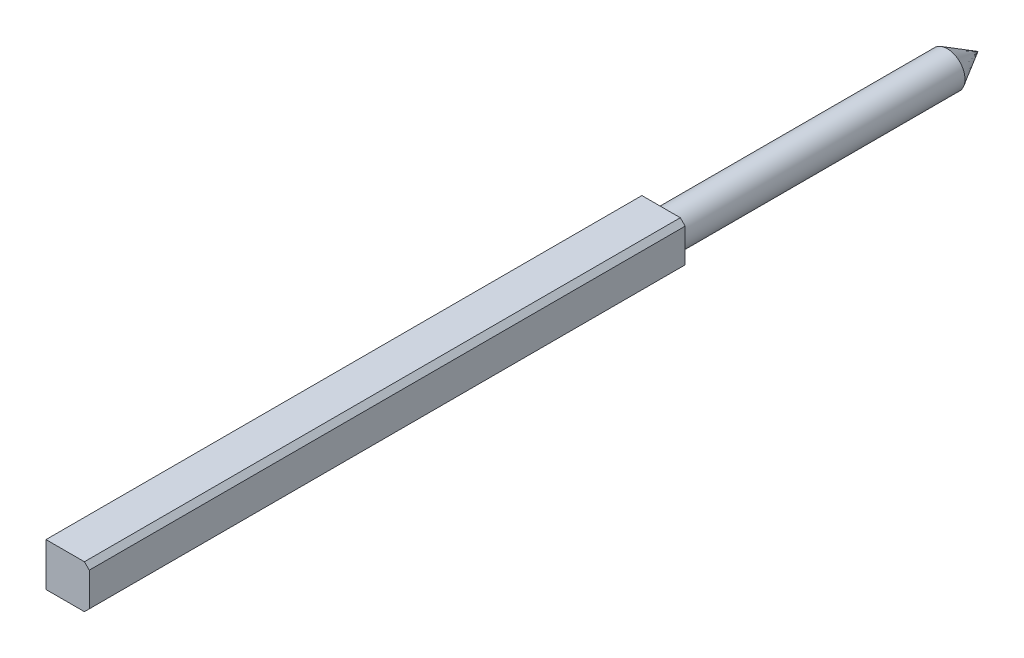
ISO-10303-21;
HEADER;
FILE_DESCRIPTION(('STEP AP214'),'2;1');
FILE_NAME('part.step','',(''),(''),'','','');
FILE_SCHEMA(('AUTOMOTIVE_DESIGN { 1 0 10303 214 1 1 1 1 }'));
ENDSEC;
DATA;
#1=APPLICATION_CONTEXT('core data for automotive mechanical design processes');
#2=APPLICATION_PROTOCOL_DEFINITION('international standard','automotive_design',2000,#1);
#3=PRODUCT_CONTEXT('',#1,'mechanical');
#4=PRODUCT('Part','Part','',(#3));
#5=PRODUCT_RELATED_PRODUCT_CATEGORY('part','',(#4));
#6=PRODUCT_DEFINITION_FORMATION('','',#4);
#7=PRODUCT_DEFINITION_CONTEXT('part definition',#1,'design');
#8=PRODUCT_DEFINITION('design','',#6,#7);
#9=PRODUCT_DEFINITION_SHAPE('','',#8);
#10=(LENGTH_UNIT() NAMED_UNIT(*) SI_UNIT(.MILLI.,.METRE.));
#11=(NAMED_UNIT(*) PLANE_ANGLE_UNIT() SI_UNIT($,.RADIAN.));
#12=(NAMED_UNIT(*) SI_UNIT($,.STERADIAN.) SOLID_ANGLE_UNIT());
#13=UNCERTAINTY_MEASURE_WITH_UNIT(LENGTH_MEASURE(1.E-05),#10,'distance_accuracy_value','');
#14=(GEOMETRIC_REPRESENTATION_CONTEXT(3) GLOBAL_UNCERTAINTY_ASSIGNED_CONTEXT((#13)) GLOBAL_UNIT_ASSIGNED_CONTEXT((#10,
#11,#12)) REPRESENTATION_CONTEXT('',''));
#15=CARTESIAN_POINT('',(0.,0.,0.));
#16=DIRECTION('',(0.,0.,1.));
#17=DIRECTION('',(1.,0.,0.));
#18=AXIS2_PLACEMENT_3D('',#15,#16,#17);
#19=CARTESIAN_POINT('',(-3.05,-3.05,84.));
#20=DIRECTION('',(0.,1.,0.));
#21=DIRECTION('',(0.,0.,1.));
#22=AXIS2_PLACEMENT_3D('',#19,#20,#21);
#23=PLANE('',#22);
#24=DIRECTION('',(1.,0.,0.));
#25=VECTOR('',#24,1.);
#26=CARTESIAN_POINT('',(-3.05,-3.05,0.));
#27=LINE('',#26,#25);
#28=CARTESIAN_POINT('',(-3.05,-3.05,0.));
#29=VERTEX_POINT('',#28);
#30=CARTESIAN_POINT('',(2.36400000000001,-3.05,0.));
#31=VERTEX_POINT('',#30);
#32=EDGE_CURVE('E119',#29,#31,#27,.T.);
#33=ORIENTED_EDGE('',*,*,#32,.T.);
#34=DIRECTION('',(0.,0.,1.));
#35=VECTOR('',#34,1.);
#36=CARTESIAN_POINT('',(2.36400000000001,-3.05,84.));
#37=LINE('',#36,#35);
#38=CARTESIAN_POINT('',(2.36400000000001,-3.05,84.));
#39=VERTEX_POINT('',#38);
#40=EDGE_CURVE('E71',#31,#39,#37,.T.);
#41=ORIENTED_EDGE('',*,*,#40,.T.);
#42=DIRECTION('',(1.,0.,0.));
#43=VECTOR('',#42,1.);
#44=CARTESIAN_POINT('',(-3.05,-3.05,84.));
#45=LINE('',#44,#43);
#46=CARTESIAN_POINT('',(-3.05,-3.05,84.));
#47=VERTEX_POINT('',#46);
#48=EDGE_CURVE('E122',#47,#39,#45,.T.);
#49=ORIENTED_EDGE('',*,*,#48,.F.);
#50=DIRECTION('',(0.,0.,-1.));
#51=VECTOR('',#50,1.);
#52=CARTESIAN_POINT('',(-3.05,-3.05,84.));
#53=LINE('',#52,#51);
#54=EDGE_CURVE('E132',#47,#29,#53,.T.);
#55=ORIENTED_EDGE('',*,*,#54,.T.);
#56=EDGE_LOOP('',(#33,#41,#49,#55));
#57=FACE_BOUND('',#56,.T.);
#58=ADVANCED_FACE('F47',(#57),#23,.F.);
#59=CARTESIAN_POINT('',(3.05,-3.05,84.));
#60=DIRECTION('',(-1.,0.,0.));
#61=DIRECTION('',(0.,0.,1.));
#62=AXIS2_PLACEMENT_3D('',#59,#60,#61);
#63=PLANE('',#62);
#64=DIRECTION('',(0.,1.,0.));
#65=VECTOR('',#64,1.);
#66=CARTESIAN_POINT('',(3.05,-3.05,84.));
#67=LINE('',#66,#65);
#68=CARTESIAN_POINT('',(3.05,-2.36400000000001,84.));
#69=VERTEX_POINT('',#68);
#70=CARTESIAN_POINT('',(3.05,2.36400000000001,84.));
#71=VERTEX_POINT('',#70);
#72=EDGE_CURVE('E124',#69,#71,#67,.T.);
#73=ORIENTED_EDGE('',*,*,#72,.F.);
#74=DIRECTION('',(0.,0.,-1.));
#75=VECTOR('',#74,1.);
#76=CARTESIAN_POINT('',(3.05,-2.36400000000001,84.));
#77=LINE('',#76,#75);
#78=CARTESIAN_POINT('',(3.05,-2.36400000000001,0.));
#79=VERTEX_POINT('',#78);
#80=EDGE_CURVE('E147',#69,#79,#77,.T.);
#81=ORIENTED_EDGE('',*,*,#80,.T.);
#82=DIRECTION('',(0.,1.,0.));
#83=VECTOR('',#82,1.);
#84=CARTESIAN_POINT('',(3.05,-3.05,0.));
#85=LINE('',#84,#83);
#86=CARTESIAN_POINT('',(3.05,2.36400000000001,0.));
#87=VERTEX_POINT('',#86);
#88=EDGE_CURVE('E134',#79,#87,#85,.T.);
#89=ORIENTED_EDGE('',*,*,#88,.T.);
#90=DIRECTION('',(0.,0.,1.));
#91=VECTOR('',#90,1.);
#92=CARTESIAN_POINT('',(3.05,2.36400000000001,84.));
#93=LINE('',#92,#91);
#94=EDGE_CURVE('E145',#87,#71,#93,.T.);
#95=ORIENTED_EDGE('',*,*,#94,.T.);
#96=EDGE_LOOP('',(#73,#81,#89,#95));
#97=FACE_BOUND('',#96,.T.);
#98=ADVANCED_FACE('F162',(#97),#63,.F.);
#99=CARTESIAN_POINT('',(-3.05,3.05,84.));
#100=DIRECTION('',(0.,1.,0.));
#101=DIRECTION('',(0.,0.,1.));
#102=AXIS2_PLACEMENT_3D('',#99,#100,#101);
#103=PLANE('',#102);
#104=DIRECTION('',(1.,0.,0.));
#105=VECTOR('',#104,1.);
#106=CARTESIAN_POINT('',(-3.05,3.05,84.));
#107=LINE('',#106,#105);
#108=CARTESIAN_POINT('',(-3.05,3.05,84.));
#109=VERTEX_POINT('',#108);
#110=CARTESIAN_POINT('',(2.36400000000001,3.05,84.));
#111=VERTEX_POINT('',#110);
#112=EDGE_CURVE('E127',#109,#111,#107,.T.);
#113=ORIENTED_EDGE('',*,*,#112,.T.);
#114=DIRECTION('',(0.,0.,-1.));
#115=VECTOR('',#114,1.);
#116=CARTESIAN_POINT('',(2.36400000000001,3.05,0.));
#117=LINE('',#116,#115);
#118=CARTESIAN_POINT('',(2.36400000000001,3.05,0.));
#119=VERTEX_POINT('',#118);
#120=EDGE_CURVE('E12',#111,#119,#117,.T.);
#121=ORIENTED_EDGE('',*,*,#120,.T.);
#122=DIRECTION('',(1.,0.,0.));
#123=VECTOR('',#122,1.);
#124=CARTESIAN_POINT('',(-3.05,3.05,0.));
#125=LINE('',#124,#123);
#126=CARTESIAN_POINT('',(-3.05,3.05,0.));
#127=VERTEX_POINT('',#126);
#128=EDGE_CURVE('E137',#127,#119,#125,.T.);
#129=ORIENTED_EDGE('',*,*,#128,.F.);
#130=DIRECTION('',(0.,0.,-1.));
#131=VECTOR('',#130,1.);
#132=CARTESIAN_POINT('',(-3.05,3.05,84.));
#133=LINE('',#132,#131);
#134=EDGE_CURVE('E143',#109,#127,#133,.T.);
#135=ORIENTED_EDGE('',*,*,#134,.F.);
#136=EDGE_LOOP('',(#113,#121,#129,#135));
#137=FACE_BOUND('',#136,.T.);
#138=ADVANCED_FACE('F173',(#137),#103,.T.);
#139=CARTESIAN_POINT('',(-3.05,-3.05,84.));
#140=DIRECTION('',(-1.,0.,0.));
#141=DIRECTION('',(0.,0.,1.));
#142=AXIS2_PLACEMENT_3D('',#139,#140,#141);
#143=PLANE('',#142);
#144=DIRECTION('',(0.,1.,0.));
#145=VECTOR('',#144,1.);
#146=CARTESIAN_POINT('',(-3.05,-3.05,0.));
#147=LINE('',#146,#145);
#148=EDGE_CURVE('E125',#29,#127,#147,.T.);
#149=ORIENTED_EDGE('',*,*,#148,.F.);
#150=ORIENTED_EDGE('',*,*,#54,.F.);
#151=DIRECTION('',(0.,1.,0.));
#152=VECTOR('',#151,1.);
#153=CARTESIAN_POINT('',(-3.05,-3.05,84.));
#154=LINE('',#153,#152);
#155=EDGE_CURVE('E129',#47,#109,#154,.T.);
#156=ORIENTED_EDGE('',*,*,#155,.T.);
#157=ORIENTED_EDGE('',*,*,#134,.T.);
#158=EDGE_LOOP('',(#149,#150,#156,#157));
#159=FACE_BOUND('',#158,.T.);
#160=ADVANCED_FACE('F170',(#159),#143,.T.);
#161=CARTESIAN_POINT('',(0.,0.,84.));
#162=DIRECTION('',(0.,0.,1.));
#163=DIRECTION('',(1.,0.,0.));
#164=AXIS2_PLACEMENT_3D('',#161,#162,#163);
#165=PLANE('',#164);
#166=ORIENTED_EDGE('',*,*,#48,.T.);
#167=DIRECTION('',(-0.707106781186548,-0.707106781186547,0.));
#168=VECTOR('',#167,1.);
#169=CARTESIAN_POINT('',(2.707,-2.70700000000001,84.));
#170=LINE('',#169,#168);
#171=EDGE_CURVE('E56',#39,#69,#170,.F.);
#172=ORIENTED_EDGE('',*,*,#171,.T.);
#173=ORIENTED_EDGE('',*,*,#72,.T.);
#174=DIRECTION('',(-0.707106781186548,0.707106781186548,0.));
#175=VECTOR('',#174,1.);
#176=CARTESIAN_POINT('',(2.707,2.707,84.));
#177=LINE('',#176,#175);
#178=EDGE_CURVE('E63',#71,#111,#177,.T.);
#179=ORIENTED_EDGE('',*,*,#178,.T.);
#180=ORIENTED_EDGE('',*,*,#112,.F.);
#181=ORIENTED_EDGE('',*,*,#155,.F.);
#182=EDGE_LOOP('',(#166,#172,#173,#179,#180,#181));
#183=FACE_BOUND('',#182,.T.);
#184=ADVANCED_FACE('F157',(#183),#165,.T.);
#185=CARTESIAN_POINT('',(0.,0.,0.));
#186=DIRECTION('',(0.,0.,1.));
#187=DIRECTION('',(1.,0.,0.));
#188=AXIS2_PLACEMENT_3D('',#185,#186,#187);
#189=PLANE('',#188);
#190=CARTESIAN_POINT('',(0.,0.,0.));
#191=DIRECTION('',(0.,0.,1.));
#192=DIRECTION('',(1.,0.,0.));
#193=AXIS2_PLACEMENT_3D('',#190,#191,#192);
#194=CIRCLE('',#193,2.5);
#195=CARTESIAN_POINT('',(2.5,0.,0.));
#196=VERTEX_POINT('',#195);
#197=EDGE_CURVE('E116',#196,#196,#194,.T.);
#198=ORIENTED_EDGE('',*,*,#197,.T.);
#199=EDGE_LOOP('',(#198));
#200=FACE_BOUND('',#199,.T.);
#201=ORIENTED_EDGE('',*,*,#88,.F.);
#202=DIRECTION('',(0.707106781186548,0.707106781186547,0.));
#203=VECTOR('',#202,1.);
#204=CARTESIAN_POINT('',(3.05,-2.36400000000001,0.));
#205=LINE('',#204,#203);
#206=EDGE_CURVE('E152',#79,#31,#205,.F.);
#207=ORIENTED_EDGE('',*,*,#206,.T.);
#208=ORIENTED_EDGE('',*,*,#32,.F.);
#209=ORIENTED_EDGE('',*,*,#148,.T.);
#210=ORIENTED_EDGE('',*,*,#128,.T.);
#211=DIRECTION('',(0.707106781186548,-0.707106781186548,0.));
#212=VECTOR('',#211,1.);
#213=CARTESIAN_POINT('',(2.36400000000001,3.05,0.));
#214=LINE('',#213,#212);
#215=EDGE_CURVE('E150',#119,#87,#214,.T.);
#216=ORIENTED_EDGE('',*,*,#215,.T.);
#217=EDGE_LOOP('',(#201,#207,#208,#209,#210,#216));
#218=FACE_BOUND('',#217,.T.);
#219=ADVANCED_FACE('F167',(#200,#218),#189,.F.);
#220=CARTESIAN_POINT('',(0.,0.,-40.));
#221=DIRECTION('',(0.,0.,1.));
#222=DIRECTION('',(1.,0.,0.));
#223=AXIS2_PLACEMENT_3D('',#220,#221,#222);
#224=CYLINDRICAL_SURFACE('',#223,2.5);
#225=CARTESIAN_POINT('',(0.,0.,-40.));
#226=DIRECTION('',(0.,0.,-1.));
#227=DIRECTION('',(-1.,0.,0.));
#228=AXIS2_PLACEMENT_3D('',#225,#226,#227);
#229=CIRCLE('',#228,2.5);
#230=CARTESIAN_POINT('',(-2.5,0.,-40.));
#231=VERTEX_POINT('',#230);
#232=EDGE_CURVE('E114',#231,#231,#229,.T.);
#233=ORIENTED_EDGE('',*,*,#232,.F.);
#234=EDGE_LOOP('',(#233));
#235=FACE_BOUND('',#234,.T.);
#236=ORIENTED_EDGE('',*,*,#197,.F.);
#237=EDGE_LOOP('',(#236));
#238=FACE_BOUND('',#237,.T.);
#239=ADVANCED_FACE('F110',(#235,#238),#224,.T.);
#240=CARTESIAN_POINT('',(0.,0.,-40.));
#241=DIRECTION('',(0.,0.,1.));
#242=DIRECTION('',(-1.,0.,0.));
#243=AXIS2_PLACEMENT_3D('',#240,#241,#242);
#244=CONICAL_SURFACE('',#243,2.5,0.5235987755983);
#245=CARTESIAN_POINT('',(0.,0.,-44.3301270189222));
#246=VERTEX_POINT('',#245);
#247=VERTEX_LOOP('',#246);
#248=FACE_BOUND('',#247,.T.);
#249=ORIENTED_EDGE('',*,*,#232,.T.);
#250=EDGE_LOOP('',(#249));
#251=FACE_BOUND('',#250,.T.);
#252=ADVANCED_FACE('F106',(#248,#251),#244,.T.);
#253=CARTESIAN_POINT('',(3.05,-2.36400000000001,84.));
#254=DIRECTION('',(-0.707106781186547,0.707106781186548,0.));
#255=DIRECTION('',(0.,0.,-1.));
#256=AXIS2_PLACEMENT_3D('',#253,#254,#255);
#257=PLANE('',#256);
#258=ORIENTED_EDGE('',*,*,#171,.F.);
#259=ORIENTED_EDGE('',*,*,#40,.F.);
#260=ORIENTED_EDGE('',*,*,#206,.F.);
#261=ORIENTED_EDGE('',*,*,#80,.F.);
#262=EDGE_LOOP('',(#258,#259,#260,#261));
#263=FACE_BOUND('',#262,.T.);
#264=ADVANCED_FACE('F109',(#263),#257,.F.);
#265=CARTESIAN_POINT('',(2.36400000000001,3.05,84.));
#266=DIRECTION('',(0.707106781186548,0.707106781186548,0.));
#267=DIRECTION('',(0.,0.,1.));
#268=AXIS2_PLACEMENT_3D('',#265,#266,#267);
#269=PLANE('',#268);
#270=ORIENTED_EDGE('',*,*,#178,.F.);
#271=ORIENTED_EDGE('',*,*,#94,.F.);
#272=ORIENTED_EDGE('',*,*,#215,.F.);
#273=ORIENTED_EDGE('',*,*,#120,.F.);
#274=EDGE_LOOP('',(#270,#271,#272,#273));
#275=FACE_BOUND('',#274,.T.);
#276=ADVANCED_FACE('F50',(#275),#269,.T.);
#277=CLOSED_SHELL('',(#58,#98,#138,#160,#184,#219,#239,#252,#264,#276));
#278=MANIFOLD_SOLID_BREP('B2',#277);
#279=ADVANCED_BREP_SHAPE_REPRESENTATION('',(#18,#278),#14);
#280=SHAPE_DEFINITION_REPRESENTATION(#9,#279);
ENDSEC;
END-ISO-10303-21;
